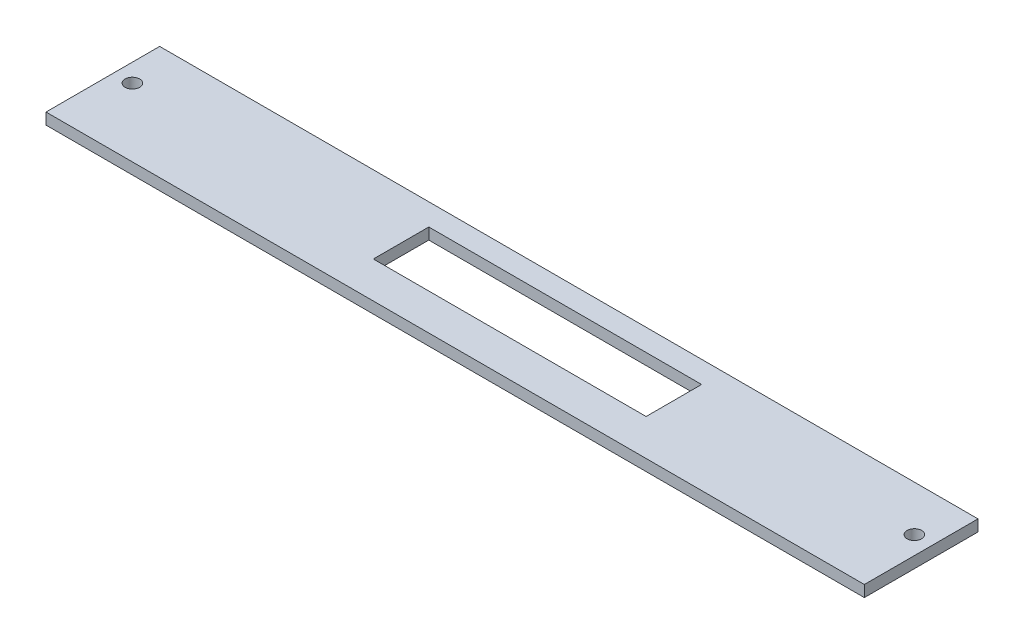
ISO-10303-21;
HEADER;
FILE_DESCRIPTION(('STEP AP214'),'2;1');
FILE_NAME('part.step','',(''),(''),'','','');
FILE_SCHEMA(('AUTOMOTIVE_DESIGN { 1 0 10303 214 1 1 1 1 }'));
ENDSEC;
DATA;
#1=APPLICATION_CONTEXT('core data for automotive mechanical design processes');
#2=APPLICATION_PROTOCOL_DEFINITION('international standard','automotive_design',2000,#1);
#3=PRODUCT_CONTEXT('',#1,'mechanical');
#4=PRODUCT('Part','Part','',(#3));
#5=PRODUCT_RELATED_PRODUCT_CATEGORY('part','',(#4));
#6=PRODUCT_DEFINITION_FORMATION('','',#4);
#7=PRODUCT_DEFINITION_CONTEXT('part definition',#1,'design');
#8=PRODUCT_DEFINITION('design','',#6,#7);
#9=PRODUCT_DEFINITION_SHAPE('','',#8);
#10=(LENGTH_UNIT() NAMED_UNIT(*) SI_UNIT(.MILLI.,.METRE.));
#11=(NAMED_UNIT(*) PLANE_ANGLE_UNIT() SI_UNIT($,.RADIAN.));
#12=(NAMED_UNIT(*) SI_UNIT($,.STERADIAN.) SOLID_ANGLE_UNIT());
#13=UNCERTAINTY_MEASURE_WITH_UNIT(LENGTH_MEASURE(1.E-05),#10,'distance_accuracy_value','');
#14=(GEOMETRIC_REPRESENTATION_CONTEXT(3) GLOBAL_UNCERTAINTY_ASSIGNED_CONTEXT((#13)) GLOBAL_UNIT_ASSIGNED_CONTEXT((#10,
#11,#12)) REPRESENTATION_CONTEXT('',''));
#15=CARTESIAN_POINT('',(0.,0.,0.));
#16=DIRECTION('',(0.,0.,1.));
#17=DIRECTION('',(1.,0.,0.));
#18=AXIS2_PLACEMENT_3D('',#15,#16,#17);
#19=CARTESIAN_POINT('',(0.,3.175,0.));
#20=DIRECTION('',(1.,0.,0.));
#21=DIRECTION('',(0.,0.,-1.));
#22=AXIS2_PLACEMENT_3D('',#19,#20,#21);
#23=PLANE('',#22);
#24=DIRECTION('',(0.,0.,1.));
#25=VECTOR('',#24,1.);
#26=CARTESIAN_POINT('',(0.,0.,0.));
#27=LINE('',#26,#25);
#28=CARTESIAN_POINT('',(0.,0.,-31.75));
#29=VERTEX_POINT('',#28);
#30=CARTESIAN_POINT('',(0.,0.,0.));
#31=VERTEX_POINT('',#30);
#32=EDGE_CURVE('E139',#29,#31,#27,.T.);
#33=ORIENTED_EDGE('',*,*,#32,.T.);
#34=DIRECTION('',(0.,-1.,0.));
#35=VECTOR('',#34,1.);
#36=CARTESIAN_POINT('',(0.,3.175,0.));
#37=LINE('',#36,#35);
#38=CARTESIAN_POINT('',(0.,3.175,0.));
#39=VERTEX_POINT('',#38);
#40=EDGE_CURVE('E11',#39,#31,#37,.T.);
#41=ORIENTED_EDGE('',*,*,#40,.F.);
#42=DIRECTION('',(0.,0.,1.));
#43=VECTOR('',#42,1.);
#44=CARTESIAN_POINT('',(0.,3.175,0.));
#45=LINE('',#44,#43);
#46=CARTESIAN_POINT('',(0.,3.175,-31.75));
#47=VERTEX_POINT('',#46);
#48=EDGE_CURVE('E148',#47,#39,#45,.T.);
#49=ORIENTED_EDGE('',*,*,#48,.F.);
#50=DIRECTION('',(0.,-1.,0.));
#51=VECTOR('',#50,1.);
#52=CARTESIAN_POINT('',(0.,3.175,-31.75));
#53=LINE('',#52,#51);
#54=EDGE_CURVE('E158',#47,#29,#53,.T.);
#55=ORIENTED_EDGE('',*,*,#54,.T.);
#56=EDGE_LOOP('',(#33,#41,#49,#55));
#57=FACE_BOUND('',#56,.T.);
#58=ADVANCED_FACE('F35',(#57),#23,.F.);
#59=CARTESIAN_POINT('',(0.,3.175,0.));
#60=DIRECTION('',(0.,0.,-1.));
#61=DIRECTION('',(-1.,0.,0.));
#62=AXIS2_PLACEMENT_3D('',#59,#60,#61);
#63=PLANE('',#62);
#64=DIRECTION('',(1.,0.,0.));
#65=VECTOR('',#64,1.);
#66=CARTESIAN_POINT('',(0.,0.,0.));
#67=LINE('',#66,#65);
#68=CARTESIAN_POINT('',(228.6,0.,0.));
#69=VERTEX_POINT('',#68);
#70=EDGE_CURVE('E161',#31,#69,#67,.T.);
#71=ORIENTED_EDGE('',*,*,#70,.T.);
#72=DIRECTION('',(0.,-1.,0.));
#73=VECTOR('',#72,1.);
#74=CARTESIAN_POINT('',(228.6,3.175,0.));
#75=LINE('',#74,#73);
#76=CARTESIAN_POINT('',(228.6,3.175,0.));
#77=VERTEX_POINT('',#76);
#78=EDGE_CURVE('E42',#77,#69,#75,.T.);
#79=ORIENTED_EDGE('',*,*,#78,.F.);
#80=DIRECTION('',(1.,0.,0.));
#81=VECTOR('',#80,1.);
#82=CARTESIAN_POINT('',(0.,3.175,0.));
#83=LINE('',#82,#81);
#84=EDGE_CURVE('E151',#39,#77,#83,.T.);
#85=ORIENTED_EDGE('',*,*,#84,.F.);
#86=ORIENTED_EDGE('',*,*,#40,.T.);
#87=EDGE_LOOP('',(#71,#79,#85,#86));
#88=FACE_BOUND('',#87,.T.);
#89=ADVANCED_FACE('F190',(#88),#63,.F.);
#90=CARTESIAN_POINT('',(228.6,3.175,0.));
#91=DIRECTION('',(-1.,0.,0.));
#92=DIRECTION('',(0.,0.,1.));
#93=AXIS2_PLACEMENT_3D('',#90,#91,#92);
#94=PLANE('',#93);
#95=DIRECTION('',(0.,0.,-1.));
#96=VECTOR('',#95,1.);
#97=CARTESIAN_POINT('',(228.6,0.,0.));
#98=LINE('',#97,#96);
#99=CARTESIAN_POINT('',(228.6,0.,-31.75));
#100=VERTEX_POINT('',#99);
#101=EDGE_CURVE('E163',#69,#100,#98,.T.);
#102=ORIENTED_EDGE('',*,*,#101,.T.);
#103=DIRECTION('',(0.,-1.,0.));
#104=VECTOR('',#103,1.);
#105=CARTESIAN_POINT('',(228.6,3.175,-31.75));
#106=LINE('',#105,#104);
#107=CARTESIAN_POINT('',(228.6,3.175,-31.75));
#108=VERTEX_POINT('',#107);
#109=EDGE_CURVE('E168',#108,#100,#106,.T.);
#110=ORIENTED_EDGE('',*,*,#109,.F.);
#111=DIRECTION('',(0.,0.,-1.));
#112=VECTOR('',#111,1.);
#113=CARTESIAN_POINT('',(228.6,3.175,0.));
#114=LINE('',#113,#112);
#115=EDGE_CURVE('E154',#77,#108,#114,.T.);
#116=ORIENTED_EDGE('',*,*,#115,.F.);
#117=ORIENTED_EDGE('',*,*,#78,.T.);
#118=EDGE_LOOP('',(#102,#110,#116,#117));
#119=FACE_BOUND('',#118,.T.);
#120=ADVANCED_FACE('F175',(#119),#94,.F.);
#121=CARTESIAN_POINT('',(0.,3.175,-31.75));
#122=DIRECTION('',(0.,0.,1.));
#123=DIRECTION('',(1.,0.,0.));
#124=AXIS2_PLACEMENT_3D('',#121,#122,#123);
#125=PLANE('',#124);
#126=DIRECTION('',(-1.,0.,0.));
#127=VECTOR('',#126,1.);
#128=CARTESIAN_POINT('',(0.,0.,-31.75));
#129=LINE('',#128,#127);
#130=EDGE_CURVE('E152',#100,#29,#129,.T.);
#131=ORIENTED_EDGE('',*,*,#130,.T.);
#132=ORIENTED_EDGE('',*,*,#54,.F.);
#133=DIRECTION('',(-1.,0.,0.));
#134=VECTOR('',#133,1.);
#135=CARTESIAN_POINT('',(0.,3.175,-31.75));
#136=LINE('',#135,#134);
#137=EDGE_CURVE('E156',#108,#47,#136,.T.);
#138=ORIENTED_EDGE('',*,*,#137,.F.);
#139=ORIENTED_EDGE('',*,*,#109,.T.);
#140=EDGE_LOOP('',(#131,#132,#138,#139));
#141=FACE_BOUND('',#140,.T.);
#142=ADVANCED_FACE('F183',(#141),#125,.F.);
#143=CARTESIAN_POINT('',(0.,3.175,0.));
#144=DIRECTION('',(0.,-1.,0.));
#145=DIRECTION('',(0.,0.,-1.));
#146=AXIS2_PLACEMENT_3D('',#143,#144,#145);
#147=PLANE('',#146);
#148=DIRECTION('',(1.,0.,0.));
#149=VECTOR('',#148,1.);
#150=CARTESIAN_POINT('',(81.28,3.175,-10.16));
#151=LINE('',#150,#149);
#152=CARTESIAN_POINT('',(81.28,3.175,-10.16));
#153=VERTEX_POINT('',#152);
#154=CARTESIAN_POINT('',(157.48,3.175,-10.16));
#155=VERTEX_POINT('',#154);
#156=EDGE_CURVE('E126',#153,#155,#151,.T.);
#157=ORIENTED_EDGE('',*,*,#156,.F.);
#158=DIRECTION('',(0.,0.,1.));
#159=VECTOR('',#158,1.);
#160=CARTESIAN_POINT('',(81.28,3.175,-25.654));
#161=LINE('',#160,#159);
#162=CARTESIAN_POINT('',(81.28,3.175,-25.654));
#163=VERTEX_POINT('',#162);
#164=EDGE_CURVE('E49',#163,#153,#161,.T.);
#165=ORIENTED_EDGE('',*,*,#164,.F.);
#166=DIRECTION('',(-1.,0.,0.));
#167=VECTOR('',#166,1.);
#168=CARTESIAN_POINT('',(81.28,3.175,-25.654));
#169=LINE('',#168,#167);
#170=CARTESIAN_POINT('',(157.48,3.175,-25.654));
#171=VERTEX_POINT('',#170);
#172=EDGE_CURVE('E117',#171,#163,#169,.T.);
#173=ORIENTED_EDGE('',*,*,#172,.F.);
#174=DIRECTION('',(0.,0.,-1.));
#175=VECTOR('',#174,1.);
#176=CARTESIAN_POINT('',(157.48,3.175,-25.654));
#177=LINE('',#176,#175);
#178=EDGE_CURVE('E120',#155,#171,#177,.T.);
#179=ORIENTED_EDGE('',*,*,#178,.F.);
#180=EDGE_LOOP('',(#157,#165,#173,#179));
#181=FACE_BOUND('',#180,.T.);
#182=CARTESIAN_POINT('',(5.08,3.175,-19.05));
#183=DIRECTION('',(0.,1.,0.));
#184=DIRECTION('',(0.,0.,1.));
#185=AXIS2_PLACEMENT_3D('',#182,#183,#184);
#186=CIRCLE('',#185,2.032);
#187=CARTESIAN_POINT('',(5.08,3.175,-17.018));
#188=VERTEX_POINT('',#187);
#189=EDGE_CURVE('E140',#188,#188,#186,.T.);
#190=ORIENTED_EDGE('',*,*,#189,.F.);
#191=EDGE_LOOP('',(#190));
#192=FACE_BOUND('',#191,.T.);
#193=CARTESIAN_POINT('',(223.52,3.175,-19.05));
#194=DIRECTION('',(0.,1.,0.));
#195=DIRECTION('',(0.,0.,1.));
#196=AXIS2_PLACEMENT_3D('',#193,#194,#195);
#197=CIRCLE('',#196,2.03200000000001);
#198=CARTESIAN_POINT('',(223.52,3.175,-17.018));
#199=VERTEX_POINT('',#198);
#200=EDGE_CURVE('E132',#199,#199,#197,.T.);
#201=ORIENTED_EDGE('',*,*,#200,.F.);
#202=EDGE_LOOP('',(#201));
#203=FACE_BOUND('',#202,.T.);
#204=ORIENTED_EDGE('',*,*,#48,.T.);
#205=ORIENTED_EDGE('',*,*,#84,.T.);
#206=ORIENTED_EDGE('',*,*,#115,.T.);
#207=ORIENTED_EDGE('',*,*,#137,.T.);
#208=EDGE_LOOP('',(#204,#205,#206,#207));
#209=FACE_BOUND('',#208,.T.);
#210=ADVANCED_FACE('F189',(#181,#192,#203,#209),#147,.F.);
#211=CARTESIAN_POINT('',(0.,0.,0.));
#212=DIRECTION('',(0.,-1.,0.));
#213=DIRECTION('',(0.,0.,-1.));
#214=AXIS2_PLACEMENT_3D('',#211,#212,#213);
#215=PLANE('',#214);
#216=DIRECTION('',(0.,0.,1.));
#217=VECTOR('',#216,1.);
#218=CARTESIAN_POINT('',(81.28,0.,-25.654));
#219=LINE('',#218,#217);
#220=CARTESIAN_POINT('',(81.28,0.,-25.654));
#221=VERTEX_POINT('',#220);
#222=CARTESIAN_POINT('',(81.28,0.,-10.16));
#223=VERTEX_POINT('',#222);
#224=EDGE_CURVE('E101',#221,#223,#219,.T.);
#225=ORIENTED_EDGE('',*,*,#224,.T.);
#226=DIRECTION('',(1.,0.,0.));
#227=VECTOR('',#226,1.);
#228=CARTESIAN_POINT('',(81.28,0.,-10.16));
#229=LINE('',#228,#227);
#230=CARTESIAN_POINT('',(157.48,0.,-10.16));
#231=VERTEX_POINT('',#230);
#232=EDGE_CURVE('E110',#223,#231,#229,.T.);
#233=ORIENTED_EDGE('',*,*,#232,.T.);
#234=DIRECTION('',(0.,0.,-1.));
#235=VECTOR('',#234,1.);
#236=CARTESIAN_POINT('',(157.48,0.,-25.654));
#237=LINE('',#236,#235);
#238=CARTESIAN_POINT('',(157.48,0.,-25.654));
#239=VERTEX_POINT('',#238);
#240=EDGE_CURVE('E57',#231,#239,#237,.T.);
#241=ORIENTED_EDGE('',*,*,#240,.T.);
#242=DIRECTION('',(-1.,0.,0.));
#243=VECTOR('',#242,1.);
#244=CARTESIAN_POINT('',(81.28,0.,-25.654));
#245=LINE('',#244,#243);
#246=EDGE_CURVE('E107',#239,#221,#245,.T.);
#247=ORIENTED_EDGE('',*,*,#246,.T.);
#248=EDGE_LOOP('',(#225,#233,#241,#247));
#249=FACE_BOUND('',#248,.T.);
#250=CARTESIAN_POINT('',(5.08,0.,-19.05));
#251=DIRECTION('',(0.,1.,0.));
#252=DIRECTION('',(0.,0.,1.));
#253=AXIS2_PLACEMENT_3D('',#250,#251,#252);
#254=CIRCLE('',#253,2.032);
#255=CARTESIAN_POINT('',(5.08,0.,-17.018));
#256=VERTEX_POINT('',#255);
#257=EDGE_CURVE('E136',#256,#256,#254,.T.);
#258=ORIENTED_EDGE('',*,*,#257,.T.);
#259=EDGE_LOOP('',(#258));
#260=FACE_BOUND('',#259,.T.);
#261=CARTESIAN_POINT('',(223.52,0.,-19.05));
#262=DIRECTION('',(0.,1.,0.));
#263=DIRECTION('',(0.,0.,1.));
#264=AXIS2_PLACEMENT_3D('',#261,#262,#263);
#265=CIRCLE('',#264,2.03200000000001);
#266=CARTESIAN_POINT('',(223.52,0.,-17.018));
#267=VERTEX_POINT('',#266);
#268=EDGE_CURVE('E143',#267,#267,#265,.T.);
#269=ORIENTED_EDGE('',*,*,#268,.T.);
#270=EDGE_LOOP('',(#269));
#271=FACE_BOUND('',#270,.T.);
#272=ORIENTED_EDGE('',*,*,#32,.F.);
#273=ORIENTED_EDGE('',*,*,#130,.F.);
#274=ORIENTED_EDGE('',*,*,#101,.F.);
#275=ORIENTED_EDGE('',*,*,#70,.F.);
#276=EDGE_LOOP('',(#272,#273,#274,#275));
#277=FACE_BOUND('',#276,.T.);
#278=ADVANCED_FACE('F114',(#249,#260,#271,#277),#215,.T.);
#279=CARTESIAN_POINT('',(223.52,0.,-19.05));
#280=DIRECTION('',(0.,1.,0.));
#281=DIRECTION('',(0.,0.,1.));
#282=AXIS2_PLACEMENT_3D('',#279,#280,#281);
#283=CYLINDRICAL_SURFACE('',#282,2.03200000000001);
#284=ORIENTED_EDGE('',*,*,#268,.F.);
#285=EDGE_LOOP('',(#284));
#286=FACE_BOUND('',#285,.T.);
#287=ORIENTED_EDGE('',*,*,#200,.T.);
#288=EDGE_LOOP('',(#287));
#289=FACE_BOUND('',#288,.T.);
#290=ADVANCED_FACE('F202',(#286,#289),#283,.F.);
#291=CARTESIAN_POINT('',(5.08,0.,-19.05));
#292=DIRECTION('',(0.,1.,0.));
#293=DIRECTION('',(0.,0.,1.));
#294=AXIS2_PLACEMENT_3D('',#291,#292,#293);
#295=CYLINDRICAL_SURFACE('',#294,2.032);
#296=ORIENTED_EDGE('',*,*,#257,.F.);
#297=EDGE_LOOP('',(#296));
#298=FACE_BOUND('',#297,.T.);
#299=ORIENTED_EDGE('',*,*,#189,.T.);
#300=EDGE_LOOP('',(#299));
#301=FACE_BOUND('',#300,.T.);
#302=ADVANCED_FACE('F208',(#298,#301),#295,.F.);
#303=CARTESIAN_POINT('',(81.28,0.,-25.654));
#304=DIRECTION('',(-1.,0.,0.));
#305=DIRECTION('',(0.,0.,1.));
#306=AXIS2_PLACEMENT_3D('',#303,#304,#305);
#307=PLANE('',#306);
#308=ORIENTED_EDGE('',*,*,#164,.T.);
#309=DIRECTION('',(0.,1.,0.));
#310=VECTOR('',#309,1.);
#311=CARTESIAN_POINT('',(81.28,0.,-10.16));
#312=LINE('',#311,#310);
#313=EDGE_CURVE('E97',#223,#153,#312,.T.);
#314=ORIENTED_EDGE('',*,*,#313,.F.);
#315=ORIENTED_EDGE('',*,*,#224,.F.);
#316=DIRECTION('',(0.,1.,0.));
#317=VECTOR('',#316,1.);
#318=CARTESIAN_POINT('',(81.28,0.,-25.654));
#319=LINE('',#318,#317);
#320=EDGE_CURVE('E130',#221,#163,#319,.T.);
#321=ORIENTED_EDGE('',*,*,#320,.T.);
#322=EDGE_LOOP('',(#308,#314,#315,#321));
#323=FACE_BOUND('',#322,.T.);
#324=ADVANCED_FACE('F99',(#323),#307,.F.);
#325=CARTESIAN_POINT('',(81.28,0.,-25.654));
#326=DIRECTION('',(0.,0.,-1.));
#327=DIRECTION('',(-1.,0.,0.));
#328=AXIS2_PLACEMENT_3D('',#325,#326,#327);
#329=PLANE('',#328);
#330=ORIENTED_EDGE('',*,*,#172,.T.);
#331=ORIENTED_EDGE('',*,*,#320,.F.);
#332=ORIENTED_EDGE('',*,*,#246,.F.);
#333=DIRECTION('',(0.,1.,0.));
#334=VECTOR('',#333,1.);
#335=CARTESIAN_POINT('',(157.48,0.,-25.654));
#336=LINE('',#335,#334);
#337=EDGE_CURVE('E133',#239,#171,#336,.T.);
#338=ORIENTED_EDGE('',*,*,#337,.T.);
#339=EDGE_LOOP('',(#330,#331,#332,#338));
#340=FACE_BOUND('',#339,.T.);
#341=ADVANCED_FACE('F215',(#340),#329,.F.);
#342=CARTESIAN_POINT('',(157.48,0.,-25.654));
#343=DIRECTION('',(1.,0.,0.));
#344=DIRECTION('',(0.,0.,-1.));
#345=AXIS2_PLACEMENT_3D('',#342,#343,#344);
#346=PLANE('',#345);
#347=ORIENTED_EDGE('',*,*,#178,.T.);
#348=ORIENTED_EDGE('',*,*,#337,.F.);
#349=ORIENTED_EDGE('',*,*,#240,.F.);
#350=DIRECTION('',(0.,1.,0.));
#351=VECTOR('',#350,1.);
#352=CARTESIAN_POINT('',(157.48,0.,-10.16));
#353=LINE('',#352,#351);
#354=EDGE_CURVE('E106',#231,#155,#353,.T.);
#355=ORIENTED_EDGE('',*,*,#354,.T.);
#356=EDGE_LOOP('',(#347,#348,#349,#355));
#357=FACE_BOUND('',#356,.T.);
#358=ADVANCED_FACE('F218',(#357),#346,.F.);
#359=CARTESIAN_POINT('',(81.28,0.,-10.16));
#360=DIRECTION('',(0.,0.,1.));
#361=DIRECTION('',(1.,0.,0.));
#362=AXIS2_PLACEMENT_3D('',#359,#360,#361);
#363=PLANE('',#362);
#364=ORIENTED_EDGE('',*,*,#156,.T.);
#365=ORIENTED_EDGE('',*,*,#354,.F.);
#366=ORIENTED_EDGE('',*,*,#232,.F.);
#367=ORIENTED_EDGE('',*,*,#313,.T.);
#368=EDGE_LOOP('',(#364,#365,#366,#367));
#369=FACE_BOUND('',#368,.T.);
#370=ADVANCED_FACE('F111',(#369),#363,.F.);
#371=CLOSED_SHELL('',(#58,#89,#120,#142,#210,#278,#290,#302,#324,#341,#358,#370));
#372=MANIFOLD_SOLID_BREP('B2',#371);
#373=ADVANCED_BREP_SHAPE_REPRESENTATION('',(#18,#372),#14);
#374=SHAPE_DEFINITION_REPRESENTATION(#9,#373);
ENDSEC;
END-ISO-10303-21;
